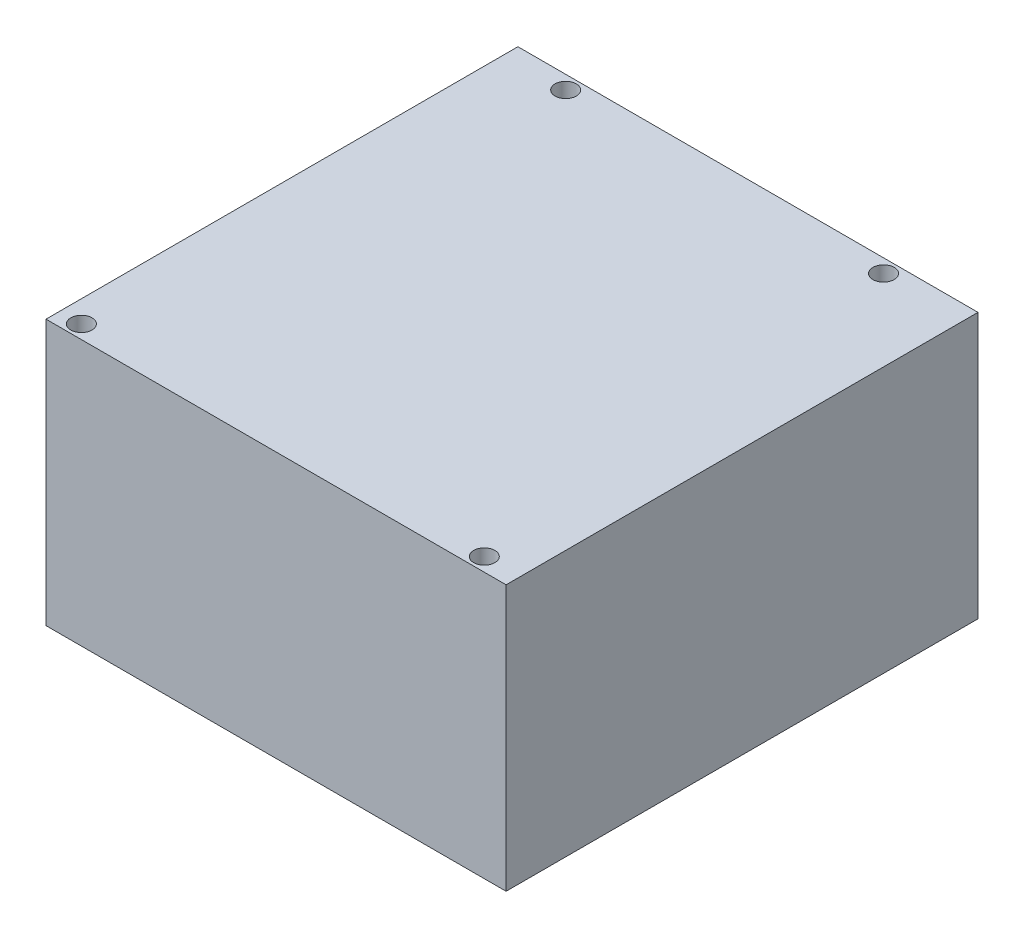
ISO-10303-21;
HEADER;
FILE_DESCRIPTION(('STEP AP214'),'2;1');
FILE_NAME('part.step','',(''),(''),'','','');
FILE_SCHEMA(('AUTOMOTIVE_DESIGN { 1 0 10303 214 1 1 1 1 }'));
ENDSEC;
DATA;
#1=APPLICATION_CONTEXT('core data for automotive mechanical design processes');
#2=APPLICATION_PROTOCOL_DEFINITION('international standard','automotive_design',2000,#1);
#3=PRODUCT_CONTEXT('',#1,'mechanical');
#4=PRODUCT('Part','Part','',(#3));
#5=PRODUCT_RELATED_PRODUCT_CATEGORY('part','',(#4));
#6=PRODUCT_DEFINITION_FORMATION('','',#4);
#7=PRODUCT_DEFINITION_CONTEXT('part definition',#1,'design');
#8=PRODUCT_DEFINITION('design','',#6,#7);
#9=PRODUCT_DEFINITION_SHAPE('','',#8);
#10=(LENGTH_UNIT() NAMED_UNIT(*) SI_UNIT(.MILLI.,.METRE.));
#11=(NAMED_UNIT(*) PLANE_ANGLE_UNIT() SI_UNIT($,.RADIAN.));
#12=(NAMED_UNIT(*) SI_UNIT($,.STERADIAN.) SOLID_ANGLE_UNIT());
#13=UNCERTAINTY_MEASURE_WITH_UNIT(LENGTH_MEASURE(1.E-05),#10,'distance_accuracy_value','');
#14=(GEOMETRIC_REPRESENTATION_CONTEXT(3) GLOBAL_UNCERTAINTY_ASSIGNED_CONTEXT((#13)) GLOBAL_UNIT_ASSIGNED_CONTEXT((#10,
#11,#12)) REPRESENTATION_CONTEXT('',''));
#15=CARTESIAN_POINT('',(0.,0.,0.));
#16=DIRECTION('',(0.,0.,1.));
#17=DIRECTION('',(1.,0.,0.));
#18=AXIS2_PLACEMENT_3D('',#15,#16,#17);
#19=CARTESIAN_POINT('',(0.,45.,0.));
#20=DIRECTION('',(0.,-1.,0.));
#21=DIRECTION('',(0.,0.,-1.));
#22=AXIS2_PLACEMENT_3D('',#19,#20,#21);
#23=PLANE('',#22);
#24=CARTESIAN_POINT('',(10.4,45.,-77.7));
#25=DIRECTION('',(0.,1.,0.));
#26=DIRECTION('',(0.,0.,1.));
#27=AXIS2_PLACEMENT_3D('',#24,#25,#26);
#28=CIRCLE('',#27,1.79999999999999);
#29=CARTESIAN_POINT('',(10.4,45.,-75.9));
#30=VERTEX_POINT('',#29);
#31=EDGE_CURVE('E130',#30,#30,#28,.T.);
#32=ORIENTED_EDGE('',*,*,#31,.F.);
#33=EDGE_LOOP('',(#32));
#34=FACE_BOUND('',#33,.T.);
#35=CARTESIAN_POINT('',(64.29,45.,-77.7));
#36=DIRECTION('',(0.,1.,0.));
#37=DIRECTION('',(0.,0.,1.));
#38=AXIS2_PLACEMENT_3D('',#35,#36,#37);
#39=CIRCLE('',#38,1.79999999999998);
#40=CARTESIAN_POINT('',(64.29,45.,-75.9));
#41=VERTEX_POINT('',#40);
#42=EDGE_CURVE('E124',#41,#41,#39,.T.);
#43=ORIENTED_EDGE('',*,*,#42,.F.);
#44=EDGE_LOOP('',(#43));
#45=FACE_BOUND('',#44,.T.);
#46=CARTESIAN_POINT('',(3.7,45.,-2.3));
#47=DIRECTION('',(0.,1.,0.));
#48=DIRECTION('',(0.,0.,1.));
#49=AXIS2_PLACEMENT_3D('',#46,#47,#48);
#50=CIRCLE('',#49,1.79999999999999);
#51=CARTESIAN_POINT('',(3.7,45.,-0.500000000000009));
#52=VERTEX_POINT('',#51);
#53=EDGE_CURVE('E112',#52,#52,#50,.T.);
#54=ORIENTED_EDGE('',*,*,#53,.F.);
#55=EDGE_LOOP('',(#54));
#56=FACE_BOUND('',#55,.T.);
#57=DIRECTION('',(0.,0.,1.));
#58=VECTOR('',#57,1.);
#59=CARTESIAN_POINT('',(0.,45.,0.));
#60=LINE('',#59,#58);
#61=CARTESIAN_POINT('',(0.,45.,-80.));
#62=VERTEX_POINT('',#61);
#63=CARTESIAN_POINT('',(0.,45.,0.));
#64=VERTEX_POINT('',#63);
#65=EDGE_CURVE('E84',#62,#64,#60,.T.);
#66=ORIENTED_EDGE('',*,*,#65,.T.);
#67=DIRECTION('',(1.,0.,0.));
#68=VECTOR('',#67,1.);
#69=CARTESIAN_POINT('',(0.,45.,0.));
#70=LINE('',#69,#68);
#71=CARTESIAN_POINT('',(78.,45.,0.));
#72=VERTEX_POINT('',#71);
#73=EDGE_CURVE('E79',#64,#72,#70,.T.);
#74=ORIENTED_EDGE('',*,*,#73,.T.);
#75=DIRECTION('',(0.,0.,-1.));
#76=VECTOR('',#75,1.);
#77=CARTESIAN_POINT('',(78.,45.,0.));
#78=LINE('',#77,#76);
#79=CARTESIAN_POINT('',(78.,45.,-80.));
#80=VERTEX_POINT('',#79);
#81=EDGE_CURVE('E82',#72,#80,#78,.T.);
#82=ORIENTED_EDGE('',*,*,#81,.T.);
#83=DIRECTION('',(-1.,0.,0.));
#84=VECTOR('',#83,1.);
#85=CARTESIAN_POINT('',(0.,45.,-80.));
#86=LINE('',#85,#84);
#87=EDGE_CURVE('E49',#80,#62,#86,.T.);
#88=ORIENTED_EDGE('',*,*,#87,.T.);
#89=EDGE_LOOP('',(#66,#74,#82,#88));
#90=FACE_BOUND('',#89,.T.);
#91=CARTESIAN_POINT('',(72.,45.,-2.3));
#92=DIRECTION('',(0.,1.,0.));
#93=DIRECTION('',(0.,0.,1.));
#94=AXIS2_PLACEMENT_3D('',#91,#92,#93);
#95=CIRCLE('',#94,1.79999999999998);
#96=CARTESIAN_POINT('',(72.,45.,-0.500000000000014));
#97=VERTEX_POINT('',#96);
#98=EDGE_CURVE('E118',#97,#97,#95,.T.);
#99=ORIENTED_EDGE('',*,*,#98,.F.);
#100=EDGE_LOOP('',(#99));
#101=FACE_BOUND('',#100,.T.);
#102=ADVANCED_FACE('F32',(#34,#45,#56,#90,#101),#23,.F.);
#103=CARTESIAN_POINT('',(0.,45.,0.));
#104=DIRECTION('',(1.,0.,0.));
#105=DIRECTION('',(0.,0.,-1.));
#106=AXIS2_PLACEMENT_3D('',#103,#104,#105);
#107=PLANE('',#106);
#108=DIRECTION('',(0.,0.,1.));
#109=VECTOR('',#108,1.);
#110=CARTESIAN_POINT('',(0.,0.,0.));
#111=LINE('',#110,#109);
#112=CARTESIAN_POINT('',(0.,0.,-80.));
#113=VERTEX_POINT('',#112);
#114=CARTESIAN_POINT('',(0.,0.,0.));
#115=VERTEX_POINT('',#114);
#116=EDGE_CURVE('E96',#113,#115,#111,.T.);
#117=ORIENTED_EDGE('',*,*,#116,.T.);
#118=DIRECTION('',(0.,-1.,0.));
#119=VECTOR('',#118,1.);
#120=CARTESIAN_POINT('',(0.,45.,0.));
#121=LINE('',#120,#119);
#122=EDGE_CURVE('E11',#64,#115,#121,.T.);
#123=ORIENTED_EDGE('',*,*,#122,.F.);
#124=ORIENTED_EDGE('',*,*,#65,.F.);
#125=DIRECTION('',(0.,-1.,0.));
#126=VECTOR('',#125,1.);
#127=CARTESIAN_POINT('',(0.,45.,-80.));
#128=LINE('',#127,#126);
#129=EDGE_CURVE('E92',#62,#113,#128,.T.);
#130=ORIENTED_EDGE('',*,*,#129,.T.);
#131=EDGE_LOOP('',(#117,#123,#124,#130));
#132=FACE_BOUND('',#131,.T.);
#133=ADVANCED_FACE('F34',(#132),#107,.F.);
#134=CARTESIAN_POINT('',(0.,45.,0.));
#135=DIRECTION('',(0.,0.,-1.));
#136=DIRECTION('',(-1.,0.,0.));
#137=AXIS2_PLACEMENT_3D('',#134,#135,#136);
#138=PLANE('',#137);
#139=DIRECTION('',(1.,0.,0.));
#140=VECTOR('',#139,1.);
#141=CARTESIAN_POINT('',(0.,0.,0.));
#142=LINE('',#141,#140);
#143=CARTESIAN_POINT('',(78.,0.,0.));
#144=VERTEX_POINT('',#143);
#145=EDGE_CURVE('E88',#115,#144,#142,.T.);
#146=ORIENTED_EDGE('',*,*,#145,.T.);
#147=DIRECTION('',(0.,-1.,0.));
#148=VECTOR('',#147,1.);
#149=CARTESIAN_POINT('',(78.,45.,0.));
#150=LINE('',#149,#148);
#151=EDGE_CURVE('E41',#72,#144,#150,.T.);
#152=ORIENTED_EDGE('',*,*,#151,.F.);
#153=ORIENTED_EDGE('',*,*,#73,.F.);
#154=ORIENTED_EDGE('',*,*,#122,.T.);
#155=EDGE_LOOP('',(#146,#152,#153,#154));
#156=FACE_BOUND('',#155,.T.);
#157=ADVANCED_FACE('F87',(#156),#138,.F.);
#158=CARTESIAN_POINT('',(78.,45.,0.));
#159=DIRECTION('',(-1.,0.,0.));
#160=DIRECTION('',(0.,0.,1.));
#161=AXIS2_PLACEMENT_3D('',#158,#159,#160);
#162=PLANE('',#161);
#163=DIRECTION('',(0.,0.,-1.));
#164=VECTOR('',#163,1.);
#165=CARTESIAN_POINT('',(78.,0.,0.));
#166=LINE('',#165,#164);
#167=CARTESIAN_POINT('',(78.,0.,-80.));
#168=VERTEX_POINT('',#167);
#169=EDGE_CURVE('E66',#144,#168,#166,.T.);
#170=ORIENTED_EDGE('',*,*,#169,.T.);
#171=DIRECTION('',(0.,-1.,0.));
#172=VECTOR('',#171,1.);
#173=CARTESIAN_POINT('',(78.,45.,-80.));
#174=LINE('',#173,#172);
#175=EDGE_CURVE('E89',#80,#168,#174,.T.);
#176=ORIENTED_EDGE('',*,*,#175,.F.);
#177=ORIENTED_EDGE('',*,*,#81,.F.);
#178=ORIENTED_EDGE('',*,*,#151,.T.);
#179=EDGE_LOOP('',(#170,#176,#177,#178));
#180=FACE_BOUND('',#179,.T.);
#181=ADVANCED_FACE('F90',(#180),#162,.F.);
#182=CARTESIAN_POINT('',(0.,45.,-80.));
#183=DIRECTION('',(0.,0.,1.));
#184=DIRECTION('',(1.,0.,0.));
#185=AXIS2_PLACEMENT_3D('',#182,#183,#184);
#186=PLANE('',#185);
#187=DIRECTION('',(-1.,0.,0.));
#188=VECTOR('',#187,1.);
#189=CARTESIAN_POINT('',(0.,0.,-80.));
#190=LINE('',#189,#188);
#191=EDGE_CURVE('E72',#168,#113,#190,.T.);
#192=ORIENTED_EDGE('',*,*,#191,.T.);
#193=ORIENTED_EDGE('',*,*,#129,.F.);
#194=ORIENTED_EDGE('',*,*,#87,.F.);
#195=ORIENTED_EDGE('',*,*,#175,.T.);
#196=EDGE_LOOP('',(#192,#193,#194,#195));
#197=FACE_BOUND('',#196,.T.);
#198=ADVANCED_FACE('F104',(#197),#186,.F.);
#199=CARTESIAN_POINT('',(0.,0.,0.));
#200=DIRECTION('',(0.,-1.,0.));
#201=DIRECTION('',(0.,0.,-1.));
#202=AXIS2_PLACEMENT_3D('',#199,#200,#201);
#203=PLANE('',#202);
#204=CARTESIAN_POINT('',(10.4,0.,-77.7));
#205=DIRECTION('',(0.,-1.,0.));
#206=DIRECTION('',(0.,0.,-1.));
#207=AXIS2_PLACEMENT_3D('',#204,#205,#206);
#208=CIRCLE('',#207,1.79999999999999);
#209=CARTESIAN_POINT('',(10.4,0.,-79.5));
#210=VERTEX_POINT('',#209);
#211=EDGE_CURVE('E127',#210,#210,#208,.T.);
#212=ORIENTED_EDGE('',*,*,#211,.F.);
#213=EDGE_LOOP('',(#212));
#214=FACE_BOUND('',#213,.T.);
#215=CARTESIAN_POINT('',(64.29,0.,-77.7));
#216=DIRECTION('',(0.,-1.,0.));
#217=DIRECTION('',(0.,0.,-1.));
#218=AXIS2_PLACEMENT_3D('',#215,#216,#217);
#219=CIRCLE('',#218,1.79999999999999);
#220=CARTESIAN_POINT('',(64.29,0.,-79.5));
#221=VERTEX_POINT('',#220);
#222=EDGE_CURVE('E121',#221,#221,#219,.T.);
#223=ORIENTED_EDGE('',*,*,#222,.F.);
#224=EDGE_LOOP('',(#223));
#225=FACE_BOUND('',#224,.T.);
#226=CARTESIAN_POINT('',(72.,0.,-2.3));
#227=DIRECTION('',(0.,-1.,0.));
#228=DIRECTION('',(0.,0.,-1.));
#229=AXIS2_PLACEMENT_3D('',#226,#227,#228);
#230=CIRCLE('',#229,1.79999999999998);
#231=CARTESIAN_POINT('',(72.,0.,-4.09999999999998));
#232=VERTEX_POINT('',#231);
#233=EDGE_CURVE('E115',#232,#232,#230,.T.);
#234=ORIENTED_EDGE('',*,*,#233,.F.);
#235=EDGE_LOOP('',(#234));
#236=FACE_BOUND('',#235,.T.);
#237=CARTESIAN_POINT('',(3.7,0.,-2.3));
#238=DIRECTION('',(0.,-1.,0.));
#239=DIRECTION('',(0.,0.,-1.));
#240=AXIS2_PLACEMENT_3D('',#237,#238,#239);
#241=CIRCLE('',#240,1.79999999999999);
#242=CARTESIAN_POINT('',(3.7,0.,-4.09999999999998));
#243=VERTEX_POINT('',#242);
#244=EDGE_CURVE('E99',#243,#243,#241,.T.);
#245=ORIENTED_EDGE('',*,*,#244,.F.);
#246=EDGE_LOOP('',(#245));
#247=FACE_BOUND('',#246,.T.);
#248=ORIENTED_EDGE('',*,*,#116,.F.);
#249=ORIENTED_EDGE('',*,*,#191,.F.);
#250=ORIENTED_EDGE('',*,*,#169,.F.);
#251=ORIENTED_EDGE('',*,*,#145,.F.);
#252=EDGE_LOOP('',(#248,#249,#250,#251));
#253=FACE_BOUND('',#252,.T.);
#254=ADVANCED_FACE('F107',(#214,#225,#236,#247,#253),#203,.T.);
#255=CARTESIAN_POINT('',(3.7,45.,-2.3));
#256=DIRECTION('',(0.,1.,0.));
#257=DIRECTION('',(0.,0.,1.));
#258=AXIS2_PLACEMENT_3D('',#255,#256,#257);
#259=CYLINDRICAL_SURFACE('',#258,1.79999999999999);
#260=ORIENTED_EDGE('',*,*,#53,.T.);
#261=EDGE_LOOP('',(#260));
#262=FACE_BOUND('',#261,.T.);
#263=ORIENTED_EDGE('',*,*,#244,.T.);
#264=EDGE_LOOP('',(#263));
#265=FACE_BOUND('',#264,.T.);
#266=ADVANCED_FACE('F144',(#262,#265),#259,.F.);
#267=CARTESIAN_POINT('',(72.,45.,-2.3));
#268=DIRECTION('',(0.,1.,0.));
#269=DIRECTION('',(0.,0.,1.));
#270=AXIS2_PLACEMENT_3D('',#267,#268,#269);
#271=CYLINDRICAL_SURFACE('',#270,1.79999999999998);
#272=ORIENTED_EDGE('',*,*,#98,.T.);
#273=EDGE_LOOP('',(#272));
#274=FACE_BOUND('',#273,.T.);
#275=ORIENTED_EDGE('',*,*,#233,.T.);
#276=EDGE_LOOP('',(#275));
#277=FACE_BOUND('',#276,.T.);
#278=ADVANCED_FACE('F147',(#274,#277),#271,.F.);
#279=CARTESIAN_POINT('',(64.29,45.,-77.7));
#280=DIRECTION('',(0.,1.,0.));
#281=DIRECTION('',(0.,0.,1.));
#282=AXIS2_PLACEMENT_3D('',#279,#280,#281);
#283=CYLINDRICAL_SURFACE('',#282,1.79999999999999);
#284=ORIENTED_EDGE('',*,*,#42,.T.);
#285=EDGE_LOOP('',(#284));
#286=FACE_BOUND('',#285,.T.);
#287=ORIENTED_EDGE('',*,*,#222,.T.);
#288=EDGE_LOOP('',(#287));
#289=FACE_BOUND('',#288,.T.);
#290=ADVANCED_FACE('F195',(#286,#289),#283,.F.);
#291=CARTESIAN_POINT('',(10.4,45.,-77.7));
#292=DIRECTION('',(0.,1.,0.));
#293=DIRECTION('',(0.,0.,1.));
#294=AXIS2_PLACEMENT_3D('',#291,#292,#293);
#295=CYLINDRICAL_SURFACE('',#294,1.79999999999999);
#296=ORIENTED_EDGE('',*,*,#31,.T.);
#297=EDGE_LOOP('',(#296));
#298=FACE_BOUND('',#297,.T.);
#299=ORIENTED_EDGE('',*,*,#211,.T.);
#300=EDGE_LOOP('',(#299));
#301=FACE_BOUND('',#300,.T.);
#302=ADVANCED_FACE('F134',(#298,#301),#295,.F.);
#303=CLOSED_SHELL('',(#102,#133,#157,#181,#198,#254,#266,#278,#290,#302));
#304=MANIFOLD_SOLID_BREP('B2',#303);
#305=ADVANCED_BREP_SHAPE_REPRESENTATION('',(#18,#304),#14);
#306=SHAPE_DEFINITION_REPRESENTATION(#9,#305);
ENDSEC;
END-ISO-10303-21;
